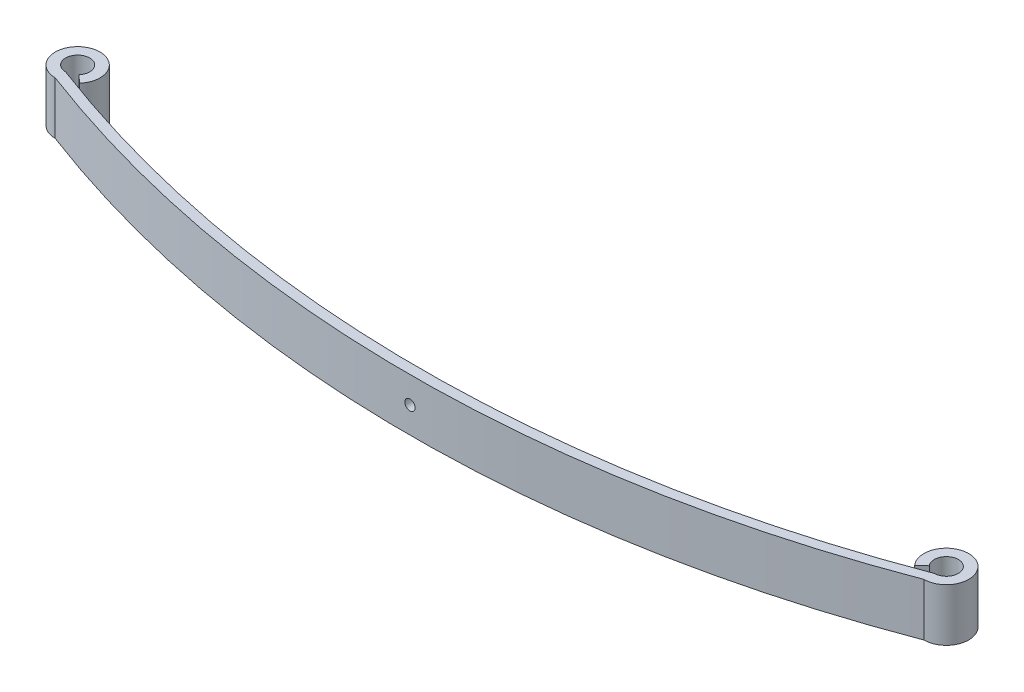
ISO-10303-21;
HEADER;
FILE_DESCRIPTION(('STEP AP214'),'2;1');
FILE_NAME('part.step','',(''),(''),'','','');
FILE_SCHEMA(('AUTOMOTIVE_DESIGN { 1 0 10303 214 1 1 1 1 }'));
ENDSEC;
DATA;
#1=APPLICATION_CONTEXT('core data for automotive mechanical design processes');
#2=APPLICATION_PROTOCOL_DEFINITION('international standard','automotive_design',2000,#1);
#3=PRODUCT_CONTEXT('',#1,'mechanical');
#4=PRODUCT('Part','Part','',(#3));
#5=PRODUCT_RELATED_PRODUCT_CATEGORY('part','',(#4));
#6=PRODUCT_DEFINITION_FORMATION('','',#4);
#7=PRODUCT_DEFINITION_CONTEXT('part definition',#1,'design');
#8=PRODUCT_DEFINITION('design','',#6,#7);
#9=PRODUCT_DEFINITION_SHAPE('','',#8);
#10=(LENGTH_UNIT() NAMED_UNIT(*) SI_UNIT(.MILLI.,.METRE.));
#11=(NAMED_UNIT(*) PLANE_ANGLE_UNIT() SI_UNIT($,.RADIAN.));
#12=(NAMED_UNIT(*) SI_UNIT($,.STERADIAN.) SOLID_ANGLE_UNIT());
#13=UNCERTAINTY_MEASURE_WITH_UNIT(LENGTH_MEASURE(1.E-05),#10,'distance_accuracy_value','');
#14=(GEOMETRIC_REPRESENTATION_CONTEXT(3) GLOBAL_UNCERTAINTY_ASSIGNED_CONTEXT((#13)) GLOBAL_UNIT_ASSIGNED_CONTEXT((#10,
#11,#12)) REPRESENTATION_CONTEXT('',''));
#15=CARTESIAN_POINT('',(0.,0.,0.));
#16=DIRECTION('',(0.,0.,1.));
#17=DIRECTION('',(1.,0.,0.));
#18=AXIS2_PLACEMENT_3D('',#15,#16,#17);
#19=CARTESIAN_POINT('',(0.,76.2,-1642.93181818182));
#20=DIRECTION('',(0.,-1.,0.));
#21=DIRECTION('',(0.,0.,-1.));
#22=AXIS2_PLACEMENT_3D('',#19,#20,#21);
#23=CYLINDRICAL_SURFACE('',#22,1775.93181818182);
#24=CARTESIAN_POINT('',(0.,0.,-1642.93181818182));
#25=DIRECTION('',(0.,-1.,0.));
#26=DIRECTION('',(0.,0.,1.));
#27=AXIS2_PLACEMENT_3D('',#24,#25,#26);
#28=CIRCLE('',#27,1775.93181818182);
#29=CARTESIAN_POINT('',(630.,0.,17.5));
#30=VERTEX_POINT('',#29);
#31=CARTESIAN_POINT('',(-630.,0.,17.5));
#32=VERTEX_POINT('',#31);
#33=EDGE_CURVE('E150',#30,#32,#28,.T.);
#34=ORIENTED_EDGE('',*,*,#33,.T.);
#35=DIRECTION('',(0.,-1.,0.));
#36=VECTOR('',#35,1.);
#37=CARTESIAN_POINT('',(-630.,76.2,17.5));
#38=LINE('',#37,#36);
#39=CARTESIAN_POINT('',(-630.,76.2,17.5));
#40=VERTEX_POINT('',#39);
#41=EDGE_CURVE('E61',#40,#32,#38,.T.);
#42=ORIENTED_EDGE('',*,*,#41,.F.);
#43=CARTESIAN_POINT('',(0.,76.2,-1642.93181818182));
#44=DIRECTION('',(0.,-1.,0.));
#45=DIRECTION('',(0.,0.,1.));
#46=AXIS2_PLACEMENT_3D('',#43,#44,#45);
#47=CIRCLE('',#46,1775.93181818182);
#48=CARTESIAN_POINT('',(630.,76.2,17.5));
#49=VERTEX_POINT('',#48);
#50=EDGE_CURVE('E165',#49,#40,#47,.T.);
#51=ORIENTED_EDGE('',*,*,#50,.F.);
#52=DIRECTION('',(0.,-1.,0.));
#53=VECTOR('',#52,1.);
#54=CARTESIAN_POINT('',(630.,76.2,17.5));
#55=LINE('',#54,#53);
#56=EDGE_CURVE('E146',#49,#30,#55,.T.);
#57=ORIENTED_EDGE('',*,*,#56,.T.);
#58=EDGE_LOOP('',(#34,#42,#51,#57));
#59=FACE_BOUND('',#58,.T.);
#60=CARTESIAN_POINT('',(-7.5,38.1,132.984163172755));
#61=CARTESIAN_POINT('',(-7.50000151322832,38.3107139679511,132.984163154948));
#62=CARTESIAN_POINT('',(-7.49111627586489,38.5214031106417,132.984200753832));
#63=CARTESIAN_POINT('',(-7.4556373522335,38.9413541812644,132.984350061186));
#64=CARTESIAN_POINT('',(-7.42903900799884,39.1506157191563,132.98446178915));
#65=CARTESIAN_POINT('',(-7.3582847919243,39.56633777246,132.98475635752));
#66=CARTESIAN_POINT('',(-7.31411328592657,39.7727956239444,132.984939261246));
#67=CARTESIAN_POINT('',(-7.20850845049177,40.1813298275784,132.985371053963));
#68=CARTESIAN_POINT('',(-7.14706881361398,40.3834045496188,132.985619967063));
#69=CARTESIAN_POINT('',(-7.00741857803516,40.7815210992524,132.986176485551));
#70=CARTESIAN_POINT('',(-6.92921922015408,40.9775668702053,132.986484051586));
#71=CARTESIAN_POINT('',(-6.75658008785521,41.3623759064741,132.98714925517));
#72=CARTESIAN_POINT('',(-6.66214006874565,41.5511390620132,132.987506893475));
#73=CARTESIAN_POINT('',(-6.45771946284224,41.9199878021357,132.988261981844));
#74=CARTESIAN_POINT('',(-6.34774304721386,42.1000756984811,132.988659421214));
#75=CARTESIAN_POINT('',(-6.11300947997288,42.4503522220647,132.989482922187));
#76=CARTESIAN_POINT('',(-5.98825198574331,42.620540619702,132.989908984454));
#77=CARTESIAN_POINT('',(-5.7248548712168,42.9497916987206,132.990777598803));
#78=CARTESIAN_POINT('',(-5.58621628331674,43.1088552060157,132.991220149656));
#79=CARTESIAN_POINT('',(-5.29598414323252,43.4147930774981,132.992109367443));
#80=CARTESIAN_POINT('',(-5.14438612150987,43.5616632016431,132.992556035749));
#81=CARTESIAN_POINT('',(-4.82940479367757,43.8420636240425,132.993440512638));
#82=CARTESIAN_POINT('',(-4.66602525421441,43.9755981535183,132.993878323996));
#83=CARTESIAN_POINT('',(-4.32853693461499,44.2284782806473,132.994732967575));
#84=CARTESIAN_POINT('',(-4.15442421518998,44.3478186211097,132.99514979199));
#85=CARTESIAN_POINT('',(-3.79679947310433,44.5713811123876,132.99595036784));
#86=CARTESIAN_POINT('',(-3.61328940571495,44.6756063909832,132.996334126111));
#87=CARTESIAN_POINT('',(-3.23813844083224,44.8682287572629,132.997057778533));
#88=CARTESIAN_POINT('',(-3.04649741698793,44.9566255988697,132.997397672001));
#89=CARTESIAN_POINT('',(-2.65645390679414,45.1169588766216,132.998023932252));
#90=CARTESIAN_POINT('',(-2.45805156600839,45.1888956668766,132.998310300186));
#91=CARTESIAN_POINT('',(-2.05588726502925,45.3158013320001,132.998821395441));
#92=CARTESIAN_POINT('',(-1.85212517956309,45.3707698098868,132.99904612132));
#93=CARTESIAN_POINT('',(-1.44073347827532,45.4633369910447,132.999427508078));
#94=CARTESIAN_POINT('',(-1.23310460039215,45.5009389739053,132.999584181809));
#95=CARTESIAN_POINT('',(-0.815345055720544,45.558531205467,132.999825121761));
#96=CARTESIAN_POINT('',(-0.605213547623086,45.5785153519182,132.999909362895));
#97=CARTESIAN_POINT('',(-0.184089749864783,45.6007035966876,133.000002936708));
#98=CARTESIAN_POINT('',(0.026902203246398,45.6029140833186,133.000012296302));
#99=CARTESIAN_POINT('',(0.448400462179423,45.5895536048992,132.999955901715));
#100=CARTESIAN_POINT('',(0.658906559933032,45.5739760744351,132.9998901198));
#101=CARTESIAN_POINT('',(1.07781602212407,45.5251445262821,132.999685285422));
#102=CARTESIAN_POINT('',(1.28621979533265,45.4918940151263,132.999546247494));
#103=CARTESIAN_POINT('',(1.69948866985384,45.4079544521514,132.999198854018));
#104=CARTESIAN_POINT('',(1.90435371605508,45.3572651290007,132.998990497393));
#105=CARTESIAN_POINT('',(2.30908164969893,45.2388094199393,132.998510385859));
#106=CARTESIAN_POINT('',(2.50894462914373,45.1710433483724,132.998238632117));
#107=CARTESIAN_POINT('',(2.90225584083381,45.0189141023773,132.997639432118));
#108=CARTESIAN_POINT('',(3.09570392286436,44.9345505396134,132.997311984558));
#109=CARTESIAN_POINT('',(3.47477166077303,44.7498423131454,132.99661075703));
#110=CARTESIAN_POINT('',(3.66039273398311,44.6495005586624,132.9962369855));
#111=CARTESIAN_POINT('',(4.02258343718359,44.4335067442225,132.995453546862));
#112=CARTESIAN_POINT('',(4.19914991102799,44.3178493953846,132.995043867371));
#113=CARTESIAN_POINT('',(4.5418601465215,44.072094952466,132.994200458956));
#114=CARTESIAN_POINT('',(4.70800761639663,43.9420030419663,132.993766738692));
#115=CARTESIAN_POINT('',(5.02877150570545,43.6683051224117,132.99288744409));
#116=CARTESIAN_POINT('',(5.18338364505771,43.5246941414881,132.992441865433));
#117=CARTESIAN_POINT('',(5.62816849421521,43.0750242219056,132.991106474746));
#118=CARTESIAN_POINT('',(5.89965900794554,42.7498630669289,132.990217057633));
#119=CARTESIAN_POINT('',(6.26270812074161,42.2319756875746,132.988961598545));
#120=CARTESIAN_POINT('',(6.37640020364901,42.0542377150174,132.988556062706));
#121=CARTESIAN_POINT('',(6.58845067458605,41.6898090573458,132.987782004378));
#122=CARTESIAN_POINT('',(6.68680870374852,41.5031181628374,132.987413482756));
#123=CARTESIAN_POINT('',(6.95766612074363,40.9316530157699,132.986380010307));
#124=CARTESIAN_POINT('',(7.10616930608197,40.5351711498846,132.985786359438));
#125=CARTESIAN_POINT('',(7.33441691473955,39.7230882798441,132.984858432532));
#126=CARTESIAN_POINT('',(7.41416134480301,39.3074872775641,132.98452415647));
#127=CARTESIAN_POINT('',(7.50278599487174,38.4688001535159,132.984151963744));
#128=CARTESIAN_POINT('',(7.51166676245162,38.0457140896111,132.984114044791));
#129=CARTESIAN_POINT('',(7.45819311126709,37.2038673914099,132.984339459835));
#130=CARTESIAN_POINT('',(7.39583869099057,36.7851067572052,132.98460279384));
#131=CARTESIAN_POINT('',(7.25040662835958,36.1696563313663,132.985200301642));
#132=CARTESIAN_POINT('',(7.19324191151712,35.9665330446174,132.985433372038));
#133=CARTESIAN_POINT('',(7.06204579979515,35.5658366930134,132.985959948923));
#134=CARTESIAN_POINT('',(6.98801479970758,35.368263498368,132.986253453997));
#135=CARTESIAN_POINT('',(6.74123134650586,34.7859391645362,132.987213155662));
#136=CARTESIAN_POINT('',(6.54370207986704,34.4112189164987,132.987958913899));
#137=CARTESIAN_POINT('',(6.20273040129458,33.8785182229737,132.98917155207));
#138=CARTESIAN_POINT('',(6.08154943369602,33.7057626900052,132.989591683636));
#139=CARTESIAN_POINT('',(5.82507601930143,33.3710651423382,132.990451451113));
#140=CARTESIAN_POINT('',(5.68978879709819,33.2091191602539,132.990891079769));
#141=CARTESIAN_POINT('',(5.40601313708408,32.8971610364584,132.991777579081));
#142=CARTESIAN_POINT('',(5.25751998842291,32.7471531897985,132.992224452276));
#143=CARTESIAN_POINT('',(4.94847371834419,32.460226900902,132.993112467549));
#144=CARTESIAN_POINT('',(4.78792478876569,32.3233039462896,132.993553611559));
#145=CARTESIAN_POINT('',(4.45583354834681,32.0634436731001,132.994417884305));
#146=CARTESIAN_POINT('',(4.28428913890837,31.9405090368345,132.994841009577));
#147=CARTESIAN_POINT('',(3.93145760301665,31.7095305858328,132.995657135662));
#148=CARTESIAN_POINT('',(3.75017070454019,31.6014864228663,132.996050137179));
#149=CARTESIAN_POINT('',(3.37913605896708,31.4010522655088,132.996794877261));
#150=CARTESIAN_POINT('',(3.18938815621962,31.3086625592515,132.997146615065));
#151=CARTESIAN_POINT('',(2.80278660656396,31.1401977929858,132.997798829411));
#152=CARTESIAN_POINT('',(2.60593307030431,31.0641224790585,132.99809930675));
#153=CARTESIAN_POINT('',(2.20647921547487,30.9288127997102,132.998640528305));
#154=CARTESIAN_POINT('',(2.0038778201388,30.8695816129755,132.998881261243));
#155=CARTESIAN_POINT('',(1.59448041085207,30.7684192781289,132.999296007566));
#156=CARTESIAN_POINT('',(1.38768597267252,30.7264817528963,132.999470045542));
#157=CARTESIAN_POINT('',(0.971224640531426,30.6601614119834,132.99974663893));
#158=CARTESIAN_POINT('',(0.761556740673634,30.6357849124769,132.999849168622));
#159=CARTESIAN_POINT('',(0.340985503705265,30.6047899446694,132.999979710025));
#160=CARTESIAN_POINT('',(0.130082619324091,30.5981653328551,133.000007747516));
#161=CARTESIAN_POINT('',(-0.291568668786524,30.6027039504275,132.999988581489));
#162=CARTESIAN_POINT('',(-0.50231703899367,30.6138702951708,132.999941364793));
#163=CARTESIAN_POINT('',(-0.922118977578929,30.6539168067114,132.999773007962));
#164=CARTESIAN_POINT('',(-1.13117258550778,30.6827965589174,132.999651869559));
#165=CARTESIAN_POINT('',(-1.54610828186128,30.7580650123924,132.999339106083));
#166=CARTESIAN_POINT('',(-1.75199030205362,30.8044540898042,132.999147479497));
#167=CARTESIAN_POINT('',(-2.15911131100798,30.9144104515269,132.998699183265));
#168=CARTESIAN_POINT('',(-2.36035037189187,30.9779774688072,132.99844251463));
#169=CARTESIAN_POINT('',(-2.75680003002422,31.1218533206432,132.997871358241));
#170=CARTESIAN_POINT('',(-2.9520093463645,31.2021656847363,132.997556858298));
#171=CARTESIAN_POINT('',(-3.33489593358475,31.3789201879569,132.99687913179));
#172=CARTESIAN_POINT('',(-3.5225759578496,31.4753563628595,132.996515923251));
#173=CARTESIAN_POINT('',(-3.88920490059733,31.6837270853476,132.995750875138));
#174=CARTESIAN_POINT('',(-4.06815101952439,31.795666558789,132.995349023297));
#175=CARTESIAN_POINT('',(-4.41591524869777,32.0341830960575,132.994518340645));
#176=CARTESIAN_POINT('',(-4.58473684338277,32.1607550795676,132.99408951922));
#177=CARTESIAN_POINT('',(-4.91113392731943,32.4276800686798,132.993216901853));
#178=CARTESIAN_POINT('',(-5.06870842915074,32.5680342817069,132.992773104601));
#179=CARTESIAN_POINT('',(-5.37147148537559,32.8615133901714,132.991883176828));
#180=CARTESIAN_POINT('',(-5.51666032671162,33.0146379895907,132.99143704636));
#181=CARTESIAN_POINT('',(-5.79366143676242,33.3326151035903,132.990554984338));
#182=CARTESIAN_POINT('',(-5.92547010878243,33.4974707514183,132.990119055549));
#183=CARTESIAN_POINT('',(-6.17472727270452,33.8376985491797,132.989269905224));
#184=CARTESIAN_POINT('',(-6.29217598089211,34.0130705406598,132.988856683347));
#185=CARTESIAN_POINT('',(-6.51195432361504,34.3732077363353,132.988064406219));
#186=CARTESIAN_POINT('',(-6.61427374206968,34.557979175388,132.987685374123));
#187=CARTESIAN_POINT('',(-6.80293588540026,34.9354206563159,132.986972696283));
#188=CARTESIAN_POINT('',(-6.88928443781847,35.1280877856943,132.986639033996));
#189=CARTESIAN_POINT('',(-7.04536751564061,35.5198427822203,132.986026685945));
#190=CARTESIAN_POINT('',(-7.1151167740923,35.718924776152,132.985747951465));
#191=CARTESIAN_POINT('',(-7.23758704265193,36.1221885373017,132.985253054081));
#192=CARTESIAN_POINT('',(-7.29031252658149,36.3263689494426,132.985036874738));
#193=CARTESIAN_POINT('',(-7.38935696991541,36.7897950847014,132.984627856377));
#194=CARTESIAN_POINT('',(-7.43081288738835,37.0500944149192,132.984454227559));
#195=CARTESIAN_POINT('',(-7.48613345736054,37.5736087387087,132.984221896869));
#196=CARTESIAN_POINT('',(-7.49999811001717,37.8368237322638,132.984163194996));
#197=CARTESIAN_POINT('',(-7.5,38.1,132.984163172755));
#198=B_SPLINE_CURVE_WITH_KNOTS('',3,(#60,#61,#62,#63,#64,#65,#66,#67,#68,#69,#70,#71,#72,#73,
#74,#75,#76,#77,#78,#79,#80,#81,#82,#83,#84,#85,#86,#87,#88,#89,#90,#91,#92,#93,#94,#95,#96,#97,
#98,#99,#100,#101,#102,#103,#104,#105,#106,#107,#108,#109,#110,#111,#112,#113,#114,#115,#116,
#117,#118,#119,#120,#121,#122,#123,#124,#125,#126,#127,#128,#129,#130,#131,#132,#133,#134,#135,
#136,#137,#138,#139,#140,#141,#142,#143,#144,#145,#146,#147,#148,#149,#150,#151,#152,#153,#154,
#155,#156,#157,#158,#159,#160,#161,#162,#163,#164,#165,#166,#167,#168,#169,#170,#171,#172,#173,
#174,#175,#176,#177,#178,#179,#180,#181,#182,#183,#184,#185,#186,#187,#188,#189,#190,#191,#192,
#193,#194,#195,#196,#197),.UNSPECIFIED.,.T.,.F.,(4,2,2,2,2,2,2,2,2,2,2,2,2,2,2,2,2,2,2,2,2,2,2,
2,2,2,2,2,2,2,2,2,2,2,2,2,2,2,2,2,2,2,2,2,2,2,2,2,2,2,2,2,2,2,2,2,2,2,2,2,2,2,2,2,2,2,2,2,4),
(0.,0.631912023867344,1.26399028554284,1.89663214467727,2.52950538661509,3.16195547862275,
3.79441510034697,4.4267052427587,5.0590100441636,5.69126785321235,6.3237446062763,
6.95602004032138,7.58852892971537,8.22090674586076,8.85329439244131,9.48566843300075,
10.1180572671324,10.7503266284151,11.3828149014489,12.0150758316766,12.6475701997658,
13.2799391201483,13.9123178800445,14.5446850001442,15.1770669176555,15.8093338259291,
16.4418196449009,17.0740790631576,17.7065719208292,18.9702098027375,19.6025836611466,
20.2349723169579,21.4986105413964,22.7622486418909,24.0258769780469,25.2895053410258,
25.9218869115188,26.5542536812702,27.8178774693666,28.4503721055268,29.0826333085495,
29.7151209650132,30.3473897125487,30.9797794963587,31.6121544885191,32.2445411188151,
32.8769179058647,33.5094139508383,34.1416765508379,34.7741664433376,35.4064374175906,
36.0388191203521,36.6711860224658,37.3035665101291,37.9359371680237,38.5684412502304,
39.2007118836389,39.8331838709524,40.4654369236773,41.0977454159362,41.7300392553246,
42.362502612682,42.9949564428901,43.6278354073147,44.2604829856393,44.8925669326172,
45.5244846334521,46.3137263270364,47.1029680161193),.UNSPECIFIED.);
#199=CARTESIAN_POINT('',(-7.5,38.1,132.984163172755));
#200=VERTEX_POINT('',#199);
#201=EDGE_CURVE('E154',#200,#200,#198,.T.);
#202=ORIENTED_EDGE('',*,*,#201,.F.);
#203=EDGE_LOOP('',(#202));
#204=FACE_BOUND('',#203,.T.);
#205=ADVANCED_FACE('F47',(#59,#204),#23,.F.);
#206=CARTESIAN_POINT('',(0.,76.2,-1627.93787683776));
#207=DIRECTION('',(0.,-1.,0.));
#208=DIRECTION('',(0.,0.,-1.));
#209=AXIS2_PLACEMENT_3D('',#206,#207,#208);
#210=CYLINDRICAL_SURFACE('',#209,1775.93787683776);
#211=CARTESIAN_POINT('',(0.,0.,-1627.93787683776));
#212=DIRECTION('',(0.,1.,0.));
#213=DIRECTION('',(0.,0.,1.));
#214=AXIS2_PLACEMENT_3D('',#211,#212,#213);
#215=CIRCLE('',#214,1775.93787683776);
#216=CARTESIAN_POINT('',(-630.001110861023,0.,32.4999999588663));
#217=VERTEX_POINT('',#216);
#218=CARTESIAN_POINT('',(630.001110861023,0.,32.4999999588664));
#219=VERTEX_POINT('',#218);
#220=EDGE_CURVE('E160',#217,#219,#215,.T.);
#221=ORIENTED_EDGE('',*,*,#220,.T.);
#222=DIRECTION('',(0.,-1.,0.));
#223=VECTOR('',#222,1.);
#224=CARTESIAN_POINT('',(630.001110861023,76.2,32.4999999588664));
#225=LINE('',#224,#223);
#226=CARTESIAN_POINT('',(630.001110861023,76.2,32.4999999588664));
#227=VERTEX_POINT('',#226);
#228=EDGE_CURVE('E141',#227,#219,#225,.T.);
#229=ORIENTED_EDGE('',*,*,#228,.F.);
#230=CARTESIAN_POINT('',(0.,76.2,-1627.93787683776));
#231=DIRECTION('',(0.,1.,0.));
#232=DIRECTION('',(0.,0.,1.));
#233=AXIS2_PLACEMENT_3D('',#230,#231,#232);
#234=CIRCLE('',#233,1775.93787683776);
#235=CARTESIAN_POINT('',(-630.001110861023,76.2,32.4999999588663));
#236=VERTEX_POINT('',#235);
#237=EDGE_CURVE('E132',#236,#227,#234,.T.);
#238=ORIENTED_EDGE('',*,*,#237,.F.);
#239=DIRECTION('',(0.,-1.,0.));
#240=VECTOR('',#239,1.);
#241=CARTESIAN_POINT('',(-630.001110861023,76.2,32.4999999588663));
#242=LINE('',#241,#240);
#243=EDGE_CURVE('E169',#236,#217,#242,.T.);
#244=ORIENTED_EDGE('',*,*,#243,.T.);
#245=EDGE_LOOP('',(#221,#229,#238,#244));
#246=FACE_BOUND('',#245,.T.);
#247=CARTESIAN_POINT('',(0.,30.6,148.));
#248=CARTESIAN_POINT('',(0.21071396796739,30.5999984867717,148.000000017794));
#249=CARTESIAN_POINT('',(0.42140311067443,30.6088837241365,147.999962419356));
#250=CARTESIAN_POINT('',(0.841354181330202,30.6443626477735,147.999813113891));
#251=CARTESIAN_POINT('',(1.0506157192389,30.6709609920123,147.999701387372));
#252=CARTESIAN_POINT('',(1.46633777257652,30.7417152080984,147.999406822485));
#253=CARTESIAN_POINT('',(1.67279562407802,30.7858867141034,147.999223920798));
#254=CARTESIAN_POINT('',(2.08132982774652,30.8914915495562,147.998792132857));
#255=CARTESIAN_POINT('',(2.28340454980432,30.9529311864447,147.998543222493));
#256=CARTESIAN_POINT('',(2.6815210994741,31.092581422049,147.997986709796));
#257=CARTESIAN_POINT('',(2.8775668704457,31.1707807799451,147.997679146815));
#258=CARTESIAN_POINT('',(3.26237590675055,31.3434199122776,147.99701394944));
#259=CARTESIAN_POINT('',(3.45113906230699,31.4378599314058,147.996656314291));
#260=CARTESIAN_POINT('',(3.81998780246153,31.6422805373497,147.995901232068));
#261=CARTESIAN_POINT('',(4.00007569882155,31.7522569529999,147.995503795688));
#262=CARTESIAN_POINT('',(4.35035222243117,31.9869905202871,147.994680300315));
#263=CARTESIAN_POINT('',(4.52054062007966,32.111748014541,147.994254240659));
#264=CARTESIAN_POINT('',(4.84979169909242,32.3751451290985,147.99338563097));
#265=CARTESIAN_POINT('',(5.00885520637211,32.5137837170032,147.992943082166));
#266=CARTESIAN_POINT('',(5.31479307782282,32.8040158570937,147.992053867845));
#267=CARTESIAN_POINT('',(5.46166320195162,32.9556138788181,147.991607200956));
#268=CARTESIAN_POINT('',(5.74206362431848,33.270595206651,147.990722726171));
#269=CARTESIAN_POINT('',(5.87559815377791,33.433974746113,147.990284915501));
#270=CARTESIAN_POINT('',(6.12847828087434,33.771463065707,147.989430272683));
#271=CARTESIAN_POINT('',(6.24781862132062,33.9455757851278,147.989013448341));
#272=CARTESIAN_POINT('',(6.47138111257311,34.303200527212,147.988212872097));
#273=CARTESIAN_POINT('',(6.57560639115861,34.4867105946045,147.987829113359));
#274=CARTESIAN_POINT('',(6.76822875741805,34.8618615594921,147.987105459654));
#275=CARTESIAN_POINT('',(6.85662559901452,35.0535025833382,147.986765565369));
#276=CARTESIAN_POINT('',(7.01695887674588,35.4435460935344,147.986139303284));
#277=CARTESIAN_POINT('',(7.0888956669907,35.6419484343208,147.985852934334));
#278=CARTESIAN_POINT('',(7.21580133209406,36.0441127353007,147.985341837082));
#279=CARTESIAN_POINT('',(7.2707698099708,36.2478748207669,147.985117110223));
#280=CARTESIAN_POINT('',(7.36333699111132,36.6592665220642,147.984735721693));
#281=CARTESIAN_POINT('',(7.40093897396372,36.866895399957,147.98457904717));
#282=CARTESIAN_POINT('',(7.45853120550747,37.2846549446477,147.984338105981));
#283=CARTESIAN_POINT('',(7.47851535194902,37.4947864527546,147.984253864403));
#284=CARTESIAN_POINT('',(7.5007035966975,37.9159102505309,147.98416029008));
#285=CARTESIAN_POINT('',(7.50291408331737,38.1269022036506,147.98415093042));
#286=CARTESIAN_POINT('',(7.48955360487425,38.5484004625997,147.984207325307));
#287=CARTESIAN_POINT('',(7.47397607439757,38.7589065603608,147.984273107588));
#288=CARTESIAN_POINT('',(7.42514452622133,39.1778160225393,147.984477943045));
#289=CARTESIAN_POINT('',(7.39189401505694,39.3862197957282,147.984616981686));
#290=CARTESIAN_POINT('',(7.30795445206822,39.7994886702093,147.984964376838));
#291=CARTESIAN_POINT('',(7.2572651289123,40.0043537163901,147.985172734427));
#292=CARTESIAN_POINT('',(7.13880941984361,40.4090816499931,147.985652847929));
#293=CARTESIAN_POINT('',(7.07104334827472,40.6089446294175,147.985924602674));
#294=CARTESIAN_POINT('',(6.9189141022788,41.0022558410673,147.986523804572));
#295=CARTESIAN_POINT('',(6.83455053951612,41.1957039230779,147.986851253027));
#296=CARTESIAN_POINT('',(6.6498423130463,41.5747716609625,147.987552482016));
#297=CARTESIAN_POINT('',(6.54950055855903,41.7603927341679,147.987926254112));
#298=CARTESIAN_POINT('',(6.33350674411068,42.1225834373595,147.988709693407));
#299=CARTESIAN_POINT('',(6.2178493952687,42.2991499111996,147.989119372989));
#300=CARTESIAN_POINT('',(5.97209495234133,42.6418601466853,147.98996278094));
#301=CARTESIAN_POINT('',(5.8420030418372,42.8080076165569,147.990396500648));
#302=CARTESIAN_POINT('',(5.56830512227287,43.1287715058592,147.991275793475));
#303=CARTESIAN_POINT('',(5.42469414134409,43.2833836452085,147.991721370911));
#304=CARTESIAN_POINT('',(4.97502422173096,43.7281684943712,147.993056756913));
#305=CARTESIAN_POINT('',(4.64986306672508,43.9996590081081,147.993946169536));
#306=CARTESIAN_POINT('',(4.13197568732338,44.3627081209078,147.995201620524));
#307=CARTESIAN_POINT('',(3.95423771474987,44.4764002038153,147.995607153434));
#308=CARTESIAN_POINT('',(3.58980905704533,44.6884506747502,147.996381205699));
#309=CARTESIAN_POINT('',(3.40311816252022,44.7868087039104,147.996749724187));
#310=CARTESIAN_POINT('',(2.83165301544818,45.0576661208732,147.997783187286));
#311=CARTESIAN_POINT('',(2.43517114957952,45.2061693061848,147.998376831983));
#312=CARTESIAN_POINT('',(1.62308827958248,45.4344169147959,147.999304748667));
#313=CARTESIAN_POINT('',(1.20748727732937,45.5141613448395,147.999639020681));
#314=CARTESIAN_POINT('',(0.368800153279906,45.602785994885,148.000011208894));
#315=CARTESIAN_POINT('',(-0.0542859106539769,45.6116667624514,148.000049127383));
#316=CARTESIAN_POINT('',(-0.896132608912235,45.55819311123,147.999823715103));
#317=CARTESIAN_POINT('',(-1.31489324314479,45.4958386909303,147.999560384327));
#318=CARTESIAN_POINT('',(-1.93034366905187,45.3504066282495,147.998962883311));
#319=CARTESIAN_POINT('',(-2.13346695584066,45.2932419113826,147.998729815502));
#320=CARTESIAN_POINT('',(-2.53416330752205,45.1620457996044,147.998203244211));
#321=CARTESIAN_POINT('',(-2.73173650220504,45.088014799485,147.997909742143));
#322=CARTESIAN_POINT('',(-3.31406083614342,44.8412313461775,147.99695004971));
#323=CARTESIAN_POINT('',(-3.68878108424503,44.6437020794538,147.996204297912));
#324=CARTESIAN_POINT('',(-4.22148177780973,44.3027304007615,147.994991668398));
#325=CARTESIAN_POINT('',(-4.39423731076581,44.181549433139,147.994571539552));
#326=CARTESIAN_POINT('',(-4.7289348584053,43.925076018698,147.993711777012));
#327=CARTESIAN_POINT('',(-4.8908808404744,43.7897887964722,147.993272150575));
#328=CARTESIAN_POINT('',(-5.2028389642367,43.5060131364152,147.992385655032));
#329=CARTESIAN_POINT('',(-5.35284681087866,43.3575199877335,147.99193878339));
#330=CARTESIAN_POINT('',(-5.63977309973651,43.0484737176166,147.991050770549));
#331=CARTESIAN_POINT('',(-5.77669605432819,42.8879247880202,147.990609627421));
#332=CARTESIAN_POINT('',(-6.03655632746867,42.5558335475758,147.989745355771));
#333=CARTESIAN_POINT('',(-6.15949096370644,42.3842891381301,147.989322230713));
#334=CARTESIAN_POINT('',(-6.39046941465233,42.0314576022276,147.98850610451));
#335=CARTESIAN_POINT('',(-6.49851357759074,41.8501707037476,147.988113102662));
#336=CARTESIAN_POINT('',(-6.69894773489246,41.4791360581708,147.987368361482));
#337=CARTESIAN_POINT('',(-6.79133744112217,41.2893881554232,147.987016622909));
#338=CARTESIAN_POINT('',(-6.95980220733358,40.90278660577,147.986364406819));
#339=CARTESIAN_POINT('',(-7.0358775212342,40.705933069513,147.986063928505));
#340=CARTESIAN_POINT('',(-7.17118720053785,40.3064792146699,147.985522704964));
#341=CARTESIAN_POINT('',(-7.23041838725264,40.1038778193168,147.985281971014));
#342=CARTESIAN_POINT('',(-7.33158072205731,39.6944804099972,147.984867222844));
#343=CARTESIAN_POINT('',(-7.37351824726791,39.4876859718017,147.984693184031));
#344=CARTESIAN_POINT('',(-7.43983858813458,39.0712246396305,147.984416589243));
#345=CARTESIAN_POINT('',(-7.46421508761679,38.8615567397584,147.984314058987));
#346=CARTESIAN_POINT('',(-7.49521005537381,38.4409855027633,147.984183516868));
#347=CARTESIAN_POINT('',(-7.5018346671618,38.2300826183697,147.984155479225));
#348=CARTESIAN_POINT('',(-7.4972960495351,37.8084313302594,147.984174645358));
#349=CARTESIAN_POINT('',(-7.48612970476568,37.5976829600649,147.984221862312));
#350=CARTESIAN_POINT('',(-7.44608319317512,37.1778810215074,147.98439022005));
#351=CARTESIAN_POINT('',(-7.41720344094522,36.9688274135937,147.984511359105));
#352=CARTESIAN_POINT('',(-7.3419349874248,36.5538917172723,147.984824124125));
#353=CARTESIAN_POINT('',(-7.29554590999144,36.348009697097,147.985015751605));
#354=CARTESIAN_POINT('',(-7.18558954822832,35.9408886881786,147.985464049754));
#355=CARTESIAN_POINT('',(-7.12202253092906,35.7396496273136,147.985720719411));
#356=CARTESIAN_POINT('',(-6.97814667905786,35.34319996922,147.986291877758));
#357=CARTESIAN_POINT('',(-6.89783431494839,35.1479906528996,147.986606378635));
#358=CARTESIAN_POINT('',(-6.72107981169766,34.7651040657198,147.987284106766));
#359=CARTESIAN_POINT('',(-6.62464363678121,34.5774240414755,147.987647315992));
#360=CARTESIAN_POINT('',(-6.41627291426767,34.2107950987687,147.988412364987));
#361=CARTESIAN_POINT('',(-6.30433344081466,34.031848979862,147.988814217021));
#362=CARTESIAN_POINT('',(-6.06581690352464,33.6840847507288,147.989644899492));
#363=CARTESIAN_POINT('',(-5.93924492000471,33.5152631560636,147.990073720543));
#364=CARTESIAN_POINT('',(-5.6723199308599,33.1888660721483,147.990946336481));
#365=CARTESIAN_POINT('',(-5.53196571780855,33.0312915703198,147.991390132677));
#366=CARTESIAN_POINT('',(-5.23848660929389,32.7285285141024,147.992280057662));
#367=CARTESIAN_POINT('',(-5.08536200984877,32.583339672771,147.992726186396));
#368=CARTESIAN_POINT('',(-4.7673848957963,32.3063385627323,147.993608244331));
#369=CARTESIAN_POINT('',(-4.60252924794132,32.1745298907195,147.994044170765));
#370=CARTESIAN_POINT('',(-4.26230145012529,31.9252727268152,147.994893315913));
#371=CARTESIAN_POINT('',(-4.08692945861761,31.807824018638,147.99530653497));
#372=CARTESIAN_POINT('',(-3.72679226290658,31.5880456759513,147.996098806146));
#373=CARTESIAN_POINT('',(-3.54202082384707,31.4857262575209,147.996477835113));
#374=CARTESIAN_POINT('',(-3.16457934290844,31.2970641142391,147.997190506772));
#375=CARTESIAN_POINT('',(-2.97191221352613,31.2107155618455,147.997524166008));
#376=CARTESIAN_POINT('',(-2.58015721699549,31.0546324840724,147.998136508007));
#377=CARTESIAN_POINT('',(-2.38107522306294,30.9848832256452,147.998415239484));
#378=CARTESIAN_POINT('',(-1.97781146191527,30.8624129571343,147.998910131445));
#379=CARTESIAN_POINT('',(-1.77363104977724,30.809687473229,147.999126308365));
#380=CARTESIAN_POINT('',(-1.310204914645,30.7106430299734,147.999535322031));
#381=CARTESIAN_POINT('',(-1.0499055845546,30.669187112542,147.999708948762));
#382=CARTESIAN_POINT('',(-0.526391261025487,30.6138665426254,147.999941276634));
#383=CARTESIAN_POINT('',(-0.2631762676034,30.6000018899828,147.999999977776));
#384=CARTESIAN_POINT('',(0.,30.6,148.));
#385=B_SPLINE_CURVE_WITH_KNOTS('',3,(#247,#248,#249,#250,#251,#252,#253,#254,#255,#256,#257,
#258,#259,#260,#261,#262,#263,#264,#265,#266,#267,#268,#269,#270,#271,#272,#273,#274,#275,#276,
#277,#278,#279,#280,#281,#282,#283,#284,#285,#286,#287,#288,#289,#290,#291,#292,#293,#294,#295,
#296,#297,#298,#299,#300,#301,#302,#303,#304,#305,#306,#307,#308,#309,#310,#311,#312,#313,#314,
#315,#316,#317,#318,#319,#320,#321,#322,#323,#324,#325,#326,#327,#328,#329,#330,#331,#332,#333,
#334,#335,#336,#337,#338,#339,#340,#341,#342,#343,#344,#345,#346,#347,#348,#349,#350,#351,#352,
#353,#354,#355,#356,#357,#358,#359,#360,#361,#362,#363,#364,#365,#366,#367,#368,#369,#370,#371,
#372,#373,#374,#375,#376,#377,#378,#379,#380,#381,#382,#383,#384),.UNSPECIFIED.,.T.,.F.,(4,2,2,
2,2,2,2,2,2,2,2,2,2,2,2,2,2,2,2,2,2,2,2,2,2,2,2,2,2,2,2,2,2,2,2,2,2,2,2,2,2,2,2,2,2,2,2,2,2,2,2,
2,2,2,2,2,2,2,2,2,2,2,2,2,2,2,2,2,4),(0.,0.631912023916504,1.26399028564126,1.89663214482521,
2.52950538681254,3.16195547887549,3.79441510065492,4.4267052431211,5.05901004458039,
5.69126785359029,6.32374460661538,6.95602004062247,7.58852892997849,8.22090674611986,
8.85329439269639,9.48566843325137,10.1180572673785,10.7503266286869,11.3828149017464,
12.0150758319993,12.6475702001137,13.2799391204434,13.9123178802869,14.5446850003347,
15.1770669177941,15.8093338260646,16.4418196450333,17.0740790632864,17.7065719209545,
18.9702098029125,19.602583661346,20.2349723171817,21.4986105415209,22.762248641919,
24.0258769781628,25.2895053412296,25.9218869118487,26.5542536817263,27.8178774700719,
28.4503721062267,29.0826333092438,29.7151209657024,30.3473897132329,30.9797794970109,
31.6121544891394,32.2445411194035,32.8769179064212,33.5094139514303,34.1416765514654,
34.7741664439998,35.4064374182874,36.0388191210151,36.6711860230951,37.3035665107252,
37.9359371685866,38.5684412507611,39.2007118841376,39.8331838714191,40.465436924112,
41.0977454164063,41.7300392558302,42.3625026132223,42.994956443465,43.6278354078556,
44.2604829861462,44.8925669330904,45.5244846338916,46.3137263270776,47.1029680157624),.UNSPECIFIED.);
#386=CARTESIAN_POINT('',(0.,30.6,148.));
#387=VERTEX_POINT('',#386);
#388=EDGE_CURVE('E11',#387,#387,#385,.T.);
#389=ORIENTED_EDGE('',*,*,#388,.F.);
#390=EDGE_LOOP('',(#389));
#391=FACE_BOUND('',#390,.T.);
#392=ADVANCED_FACE('F223',(#246,#391),#210,.T.);
#393=CARTESIAN_POINT('',(-630.,76.2,0.));
#394=DIRECTION('',(0.,-1.,0.));
#395=DIRECTION('',(0.,0.,-1.));
#396=AXIS2_PLACEMENT_3D('',#393,#394,#395);
#397=CYLINDRICAL_SURFACE('',#396,17.5);
#398=CARTESIAN_POINT('',(-630.,0.,0.));
#399=DIRECTION('',(0.,-1.,0.));
#400=DIRECTION('',(0.,0.,1.));
#401=AXIS2_PLACEMENT_3D('',#398,#399,#400);
#402=CIRCLE('',#401,17.5);
#403=CARTESIAN_POINT('',(-616.83496243817,0.,11.5296047632003));
#404=VERTEX_POINT('',#403);
#405=EDGE_CURVE('E153',#32,#404,#402,.T.);
#406=ORIENTED_EDGE('',*,*,#405,.T.);
#407=DIRECTION('',(0.,-1.,0.));
#408=VECTOR('',#407,1.);
#409=CARTESIAN_POINT('',(-616.83496243817,76.2,11.5296047632003));
#410=LINE('',#409,#408);
#411=CARTESIAN_POINT('',(-616.83496243817,76.2,11.5296047632003));
#412=VERTEX_POINT('',#411);
#413=EDGE_CURVE('E175',#412,#404,#410,.T.);
#414=ORIENTED_EDGE('',*,*,#413,.F.);
#415=CARTESIAN_POINT('',(-630.,76.2,0.));
#416=DIRECTION('',(0.,-1.,0.));
#417=DIRECTION('',(0.,0.,1.));
#418=AXIS2_PLACEMENT_3D('',#415,#416,#417);
#419=CIRCLE('',#418,17.5);
#420=EDGE_CURVE('E113',#40,#412,#419,.T.);
#421=ORIENTED_EDGE('',*,*,#420,.F.);
#422=ORIENTED_EDGE('',*,*,#41,.T.);
#423=EDGE_LOOP('',(#406,#414,#421,#422));
#424=FACE_BOUND('',#423,.T.);
#425=ADVANCED_FACE('F178',(#424),#397,.F.);
#426=CARTESIAN_POINT('',(-616.83496243817,76.2,11.5296047632003));
#427=DIRECTION('',(0.658834557897161,0.,-0.752287860675986));
#428=DIRECTION('',(-0.752287860675986,0.,-0.658834557897161));
#429=AXIS2_PLACEMENT_3D('',#426,#427,#428);
#430=PLANE('',#429);
#431=DIRECTION('',(0.752287860675986,0.,0.658834557897161));
#432=VECTOR('',#431,1.);
#433=CARTESIAN_POINT('',(-616.83496243817,0.,11.5296047632003));
#434=LINE('',#433,#432);
#435=CARTESIAN_POINT('',(-605.550644544693,0.,21.4121231170653));
#436=VERTEX_POINT('',#435);
#437=EDGE_CURVE('E156',#404,#436,#434,.T.);
#438=ORIENTED_EDGE('',*,*,#437,.T.);
#439=DIRECTION('',(0.,-1.,0.));
#440=VECTOR('',#439,1.);
#441=CARTESIAN_POINT('',(-605.550644544693,76.2,21.4121231170653));
#442=LINE('',#441,#440);
#443=CARTESIAN_POINT('',(-605.550644544693,76.2,21.4121231170653));
#444=VERTEX_POINT('',#443);
#445=EDGE_CURVE('E172',#444,#436,#442,.T.);
#446=ORIENTED_EDGE('',*,*,#445,.F.);
#447=DIRECTION('',(0.752287860675986,0.,0.658834557897161));
#448=VECTOR('',#447,1.);
#449=CARTESIAN_POINT('',(-616.83496243817,76.2,11.5296047632003));
#450=LINE('',#449,#448);
#451=EDGE_CURVE('E197',#412,#444,#450,.T.);
#452=ORIENTED_EDGE('',*,*,#451,.F.);
#453=ORIENTED_EDGE('',*,*,#413,.T.);
#454=EDGE_LOOP('',(#438,#446,#452,#453));
#455=FACE_BOUND('',#454,.T.);
#456=ADVANCED_FACE('F190',(#455),#430,.F.);
#457=CARTESIAN_POINT('',(-630.,76.2,0.));
#458=DIRECTION('',(0.,-1.,0.));
#459=DIRECTION('',(0.,0.,-1.));
#460=AXIS2_PLACEMENT_3D('',#457,#458,#459);
#461=CYLINDRICAL_SURFACE('',#460,32.4999999778511);
#462=CARTESIAN_POINT('',(-630.,0.,0.));
#463=DIRECTION('',(0.,1.,0.));
#464=DIRECTION('',(0.,0.,1.));
#465=AXIS2_PLACEMENT_3D('',#462,#463,#464);
#466=CIRCLE('',#465,32.4999999778511);
#467=EDGE_CURVE('E158',#436,#217,#466,.T.);
#468=ORIENTED_EDGE('',*,*,#467,.T.);
#469=ORIENTED_EDGE('',*,*,#243,.F.);
#470=CARTESIAN_POINT('',(-630.,76.2,0.));
#471=DIRECTION('',(0.,1.,0.));
#472=DIRECTION('',(0.,0.,1.));
#473=AXIS2_PLACEMENT_3D('',#470,#471,#472);
#474=CIRCLE('',#473,32.4999999778511);
#475=EDGE_CURVE('E196',#444,#236,#474,.T.);
#476=ORIENTED_EDGE('',*,*,#475,.F.);
#477=ORIENTED_EDGE('',*,*,#445,.T.);
#478=EDGE_LOOP('',(#468,#469,#476,#477));
#479=FACE_BOUND('',#478,.T.);
#480=ADVANCED_FACE('F194',(#479),#461,.T.);
#481=CARTESIAN_POINT('',(630.,76.2,0.));
#482=DIRECTION('',(0.,-1.,0.));
#483=DIRECTION('',(0.,0.,-1.));
#484=AXIS2_PLACEMENT_3D('',#481,#482,#483);
#485=CYLINDRICAL_SURFACE('',#484,32.499999977851);
#486=CARTESIAN_POINT('',(630.,0.,0.));
#487=DIRECTION('',(0.,1.,0.));
#488=DIRECTION('',(0.,0.,1.));
#489=AXIS2_PLACEMENT_3D('',#486,#487,#488);
#490=CIRCLE('',#489,32.499999977851);
#491=CARTESIAN_POINT('',(605.550644544693,0.,21.4121231170653));
#492=VERTEX_POINT('',#491);
#493=EDGE_CURVE('E140',#219,#492,#490,.T.);
#494=ORIENTED_EDGE('',*,*,#493,.T.);
#495=DIRECTION('',(0.,-1.,0.));
#496=VECTOR('',#495,1.);
#497=CARTESIAN_POINT('',(605.550644544693,76.2,21.4121231170653));
#498=LINE('',#497,#496);
#499=CARTESIAN_POINT('',(605.550644544693,76.2,21.4121231170653));
#500=VERTEX_POINT('',#499);
#501=EDGE_CURVE('E137',#500,#492,#498,.T.);
#502=ORIENTED_EDGE('',*,*,#501,.F.);
#503=CARTESIAN_POINT('',(630.,76.2,0.));
#504=DIRECTION('',(0.,1.,0.));
#505=DIRECTION('',(0.,0.,1.));
#506=AXIS2_PLACEMENT_3D('',#503,#504,#505);
#507=CIRCLE('',#506,32.499999977851);
#508=EDGE_CURVE('E126',#227,#500,#507,.T.);
#509=ORIENTED_EDGE('',*,*,#508,.F.);
#510=ORIENTED_EDGE('',*,*,#228,.T.);
#511=EDGE_LOOP('',(#494,#502,#509,#510));
#512=FACE_BOUND('',#511,.T.);
#513=ADVANCED_FACE('F138',(#512),#485,.T.);
#514=CARTESIAN_POINT('',(616.83496243817,76.2,11.5296047632003));
#515=DIRECTION('',(-0.658834557897162,0.,-0.752287860675985));
#516=DIRECTION('',(-0.752287860675985,0.,0.658834557897162));
#517=AXIS2_PLACEMENT_3D('',#514,#515,#516);
#518=PLANE('',#517);
#519=DIRECTION('',(0.752287860675985,0.,-0.658834557897162));
#520=VECTOR('',#519,1.);
#521=CARTESIAN_POINT('',(616.83496243817,0.,11.5296047632003));
#522=LINE('',#521,#520);
#523=CARTESIAN_POINT('',(616.83496243817,0.,11.5296047632003));
#524=VERTEX_POINT('',#523);
#525=EDGE_CURVE('E98',#492,#524,#522,.T.);
#526=ORIENTED_EDGE('',*,*,#525,.T.);
#527=DIRECTION('',(0.,-1.,0.));
#528=VECTOR('',#527,1.);
#529=CARTESIAN_POINT('',(616.83496243817,76.2,11.5296047632003));
#530=LINE('',#529,#528);
#531=CARTESIAN_POINT('',(616.83496243817,76.2,11.5296047632003));
#532=VERTEX_POINT('',#531);
#533=EDGE_CURVE('E142',#532,#524,#530,.T.);
#534=ORIENTED_EDGE('',*,*,#533,.F.);
#535=DIRECTION('',(0.752287860675985,0.,-0.658834557897162));
#536=VECTOR('',#535,1.);
#537=CARTESIAN_POINT('',(616.83496243817,76.2,11.5296047632003));
#538=LINE('',#537,#536);
#539=EDGE_CURVE('E130',#500,#532,#538,.T.);
#540=ORIENTED_EDGE('',*,*,#539,.F.);
#541=ORIENTED_EDGE('',*,*,#501,.T.);
#542=EDGE_LOOP('',(#526,#534,#540,#541));
#543=FACE_BOUND('',#542,.T.);
#544=ADVANCED_FACE('F144',(#543),#518,.F.);
#545=CARTESIAN_POINT('',(630.,76.2,0.));
#546=DIRECTION('',(0.,-1.,0.));
#547=DIRECTION('',(0.,0.,-1.));
#548=AXIS2_PLACEMENT_3D('',#545,#546,#547);
#549=CYLINDRICAL_SURFACE('',#548,17.5);
#550=CARTESIAN_POINT('',(630.,0.,0.));
#551=DIRECTION('',(0.,-1.,0.));
#552=DIRECTION('',(0.,0.,1.));
#553=AXIS2_PLACEMENT_3D('',#550,#551,#552);
#554=CIRCLE('',#553,17.5);
#555=EDGE_CURVE('E104',#524,#30,#554,.T.);
#556=ORIENTED_EDGE('',*,*,#555,.T.);
#557=ORIENTED_EDGE('',*,*,#56,.F.);
#558=CARTESIAN_POINT('',(630.,76.2,0.));
#559=DIRECTION('',(0.,-1.,0.));
#560=DIRECTION('',(0.,0.,1.));
#561=AXIS2_PLACEMENT_3D('',#558,#559,#560);
#562=CIRCLE('',#561,17.5);
#563=EDGE_CURVE('E69',#532,#49,#562,.T.);
#564=ORIENTED_EDGE('',*,*,#563,.F.);
#565=ORIENTED_EDGE('',*,*,#533,.T.);
#566=EDGE_LOOP('',(#556,#557,#564,#565));
#567=FACE_BOUND('',#566,.T.);
#568=ADVANCED_FACE('F215',(#567),#549,.F.);
#569=CARTESIAN_POINT('',(0.,76.2,-1642.93181818182));
#570=DIRECTION('',(0.,1.,0.));
#571=DIRECTION('',(0.,0.,1.));
#572=AXIS2_PLACEMENT_3D('',#569,#570,#571);
#573=PLANE('',#572);
#574=ORIENTED_EDGE('',*,*,#50,.T.);
#575=ORIENTED_EDGE('',*,*,#420,.T.);
#576=ORIENTED_EDGE('',*,*,#451,.T.);
#577=ORIENTED_EDGE('',*,*,#475,.T.);
#578=ORIENTED_EDGE('',*,*,#237,.T.);
#579=ORIENTED_EDGE('',*,*,#508,.T.);
#580=ORIENTED_EDGE('',*,*,#539,.T.);
#581=ORIENTED_EDGE('',*,*,#563,.T.);
#582=EDGE_LOOP('',(#574,#575,#576,#577,#578,#579,#580,#581));
#583=FACE_BOUND('',#582,.T.);
#584=ADVANCED_FACE('F128',(#583),#573,.T.);
#585=CARTESIAN_POINT('',(0.,0.,-1642.93181818182));
#586=DIRECTION('',(0.,1.,0.));
#587=DIRECTION('',(0.,0.,1.));
#588=AXIS2_PLACEMENT_3D('',#585,#586,#587);
#589=PLANE('',#588);
#590=ORIENTED_EDGE('',*,*,#33,.F.);
#591=ORIENTED_EDGE('',*,*,#555,.F.);
#592=ORIENTED_EDGE('',*,*,#525,.F.);
#593=ORIENTED_EDGE('',*,*,#493,.F.);
#594=ORIENTED_EDGE('',*,*,#220,.F.);
#595=ORIENTED_EDGE('',*,*,#467,.F.);
#596=ORIENTED_EDGE('',*,*,#437,.F.);
#597=ORIENTED_EDGE('',*,*,#405,.F.);
#598=EDGE_LOOP('',(#590,#591,#592,#593,#594,#595,#596,#597));
#599=FACE_BOUND('',#598,.T.);
#600=ADVANCED_FACE('F184',(#599),#589,.F.);
#601=CARTESIAN_POINT('',(0.,38.1,148.));
#602=DIRECTION('',(0.,0.,-1.));
#603=DIRECTION('',(-1.,0.,0.));
#604=AXIS2_PLACEMENT_3D('',#601,#602,#603);
#605=CYLINDRICAL_SURFACE('',#604,7.5);
#606=ORIENTED_EDGE('',*,*,#388,.T.);
#607=EDGE_LOOP('',(#606));
#608=FACE_BOUND('',#607,.T.);
#609=ORIENTED_EDGE('',*,*,#201,.T.);
#610=EDGE_LOOP('',(#609));
#611=FACE_BOUND('',#610,.T.);
#612=ADVANCED_FACE('F207',(#608,#611),#605,.F.);
#613=CLOSED_SHELL('',(#205,#392,#425,#456,#480,#513,#544,#568,#584,#600,#612));
#614=MANIFOLD_SOLID_BREP('B2',#613);
#615=ADVANCED_BREP_SHAPE_REPRESENTATION('',(#18,#614),#14);
#616=SHAPE_DEFINITION_REPRESENTATION(#9,#615);
ENDSEC;
END-ISO-10303-21;
